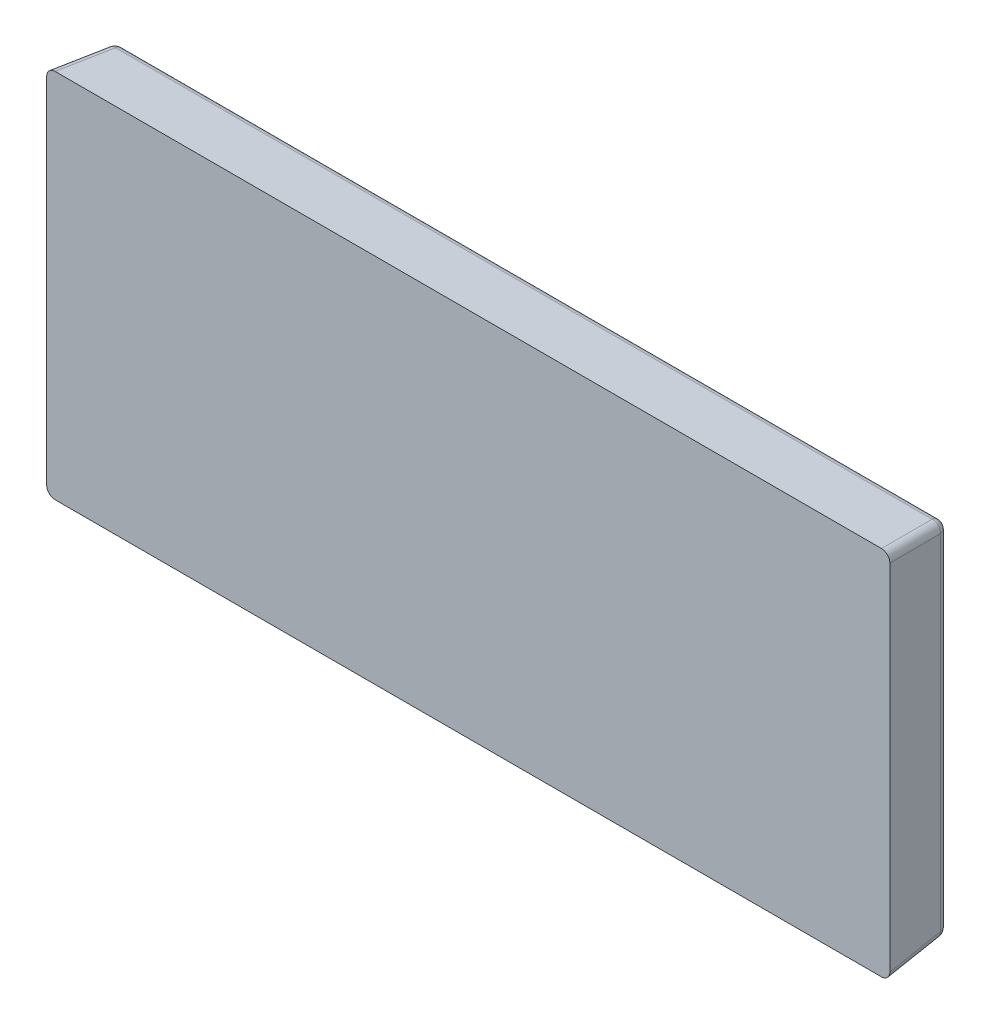
ISO-10303-21;
HEADER;
FILE_DESCRIPTION(('STEP AP214'),'2;1');
FILE_NAME('part.step','',(''),(''),'','','');
FILE_SCHEMA(('AUTOMOTIVE_DESIGN { 1 0 10303 214 1 1 1 1 }'));
ENDSEC;
DATA;
#1=APPLICATION_CONTEXT('core data for automotive mechanical design processes');
#2=APPLICATION_PROTOCOL_DEFINITION('international standard','automotive_design',2000,#1);
#3=PRODUCT_CONTEXT('',#1,'mechanical');
#4=PRODUCT('Part','Part','',(#3));
#5=PRODUCT_RELATED_PRODUCT_CATEGORY('part','',(#4));
#6=PRODUCT_DEFINITION_FORMATION('','',#4);
#7=PRODUCT_DEFINITION_CONTEXT('part definition',#1,'design');
#8=PRODUCT_DEFINITION('design','',#6,#7);
#9=PRODUCT_DEFINITION_SHAPE('','',#8);
#10=(LENGTH_UNIT() NAMED_UNIT(*) SI_UNIT(.MILLI.,.METRE.));
#11=(NAMED_UNIT(*) PLANE_ANGLE_UNIT() SI_UNIT($,.RADIAN.));
#12=(NAMED_UNIT(*) SI_UNIT($,.STERADIAN.) SOLID_ANGLE_UNIT());
#13=UNCERTAINTY_MEASURE_WITH_UNIT(LENGTH_MEASURE(1.E-05),#10,'distance_accuracy_value','');
#14=(GEOMETRIC_REPRESENTATION_CONTEXT(3) GLOBAL_UNCERTAINTY_ASSIGNED_CONTEXT((#13)) GLOBAL_UNIT_ASSIGNED_CONTEXT((#10,
#11,#12)) REPRESENTATION_CONTEXT('',''));
#15=CARTESIAN_POINT('',(0.,0.,0.));
#16=DIRECTION('',(0.,0.,1.));
#17=DIRECTION('',(1.,0.,0.));
#18=AXIS2_PLACEMENT_3D('',#15,#16,#17);
#19=CARTESIAN_POINT('',(-5.,-2.2,-0.75));
#20=DIRECTION('',(0.,0.,-1.));
#21=DIRECTION('',(0.,-1.,0.));
#22=AXIS2_PLACEMENT_3D('',#19,#20,#21);
#23=PLANE('',#22);
#24=DIRECTION('',(0.,-1.,0.));
#25=VECTOR('',#24,1.);
#26=CARTESIAN_POINT('',(-4.84275038495381,-2.2,-0.75));
#27=LINE('',#26,#25);
#28=CARTESIAN_POINT('',(-4.84275038495382,2.04275038495382,-0.75));
#29=VERTEX_POINT('',#28);
#30=CARTESIAN_POINT('',(-4.84275038495381,-2.04275038495382,-0.75));
#31=VERTEX_POINT('',#30);
#32=EDGE_CURVE('E41',#29,#31,#27,.T.);
#33=ORIENTED_EDGE('',*,*,#32,.F.);
#34=DIRECTION('',(-1.,0.,0.));
#35=VECTOR('',#34,1.);
#36=CARTESIAN_POINT('',(-5.,2.04275038495382,-0.75));
#37=LINE('',#36,#35);
#38=CARTESIAN_POINT('',(4.84275038495382,2.04275038495382,-0.75));
#39=VERTEX_POINT('',#38);
#40=EDGE_CURVE('E11',#39,#29,#37,.T.);
#41=ORIENTED_EDGE('',*,*,#40,.F.);
#42=DIRECTION('',(0.,1.,0.));
#43=VECTOR('',#42,1.);
#44=CARTESIAN_POINT('',(4.84275038495382,-2.2,-0.75));
#45=LINE('',#44,#43);
#46=CARTESIAN_POINT('',(4.84275038495382,-2.04275038495382,-0.75));
#47=VERTEX_POINT('',#46);
#48=EDGE_CURVE('E193',#47,#39,#45,.T.);
#49=ORIENTED_EDGE('',*,*,#48,.F.);
#50=DIRECTION('',(1.,0.,0.));
#51=VECTOR('',#50,1.);
#52=CARTESIAN_POINT('',(-5.,-2.04275038495382,-0.75));
#53=LINE('',#52,#51);
#54=EDGE_CURVE('E185',#31,#47,#53,.T.);
#55=ORIENTED_EDGE('',*,*,#54,.F.);
#56=EDGE_LOOP('',(#33,#41,#49,#55));
#57=FACE_BOUND('',#56,.T.);
#58=ADVANCED_FACE('F16',(#57),#23,.T.);
#59=CARTESIAN_POINT('',(-4.84275038495382,2.04275038495382,-0.65));
#60=DIRECTION('',(-0.754900044750231,0.,0.655839860359294));
#61=DIRECTION('',(-0.359708459501919,-0.836170262039059,-0.414039994498464));
#62=AXIS2_PLACEMENT_3D('',#59,#60,#61);
#63=SPHERICAL_SURFACE('',#62,0.0999999999999954);
#64=CARTESIAN_POINT('',(-4.84275038495382,2.04275038495382,-0.65));
#65=DIRECTION('',(1.,0.,0.));
#66=DIRECTION('',(0.,0.,-1.));
#67=AXIS2_PLACEMENT_3D('',#64,#65,#66);
#68=CIRCLE('',#67,0.1);
#69=CARTESIAN_POINT('',(-4.84275038495382,2.14236985476299,-0.658715574274766));
#70=VERTEX_POINT('',#69);
#71=EDGE_CURVE('E27',#29,#70,#68,.T.);
#72=ORIENTED_EDGE('',*,*,#71,.F.);
#73=CARTESIAN_POINT('',(-4.84275038495382,2.04275038495382,-0.65));
#74=DIRECTION('',(0.,-1.,0.));
#75=DIRECTION('',(-1.,0.,0.));
#76=AXIS2_PLACEMENT_3D('',#73,#74,#75);
#77=CIRCLE('',#76,0.1);
#78=CARTESIAN_POINT('',(-4.94236985476299,2.04275038495382,-0.658715574274766));
#79=VERTEX_POINT('',#78);
#80=EDGE_CURVE('E204',#79,#29,#77,.T.);
#81=ORIENTED_EDGE('',*,*,#80,.F.);
#82=CARTESIAN_POINT('',(-4.84275038495382,2.04275038495382,-0.65));
#83=DIRECTION('',(-0.0868265938642476,0.0868265938642477,0.992432509138967));
#84=DIRECTION('',(0.996194698091746,0.,0.0871557427476582));
#85=AXIS2_PLACEMENT_3D('',#82,#83,#84);
#86=CIRCLE('',#85,0.1);
#87=EDGE_CURVE('E207',#70,#79,#86,.T.);
#88=ORIENTED_EDGE('',*,*,#87,.F.);
#89=EDGE_LOOP('',(#72,#81,#88));
#90=FACE_BOUND('',#89,.T.);
#91=ADVANCED_FACE('F322',(#90),#63,.T.);
#92=CARTESIAN_POINT('',(-5.,2.04275038495382,-0.65));
#93=DIRECTION('',(1.,0.,0.));
#94=DIRECTION('',(0.,0.,-1.));
#95=AXIS2_PLACEMENT_3D('',#92,#93,#94);
#96=CYLINDRICAL_SURFACE('',#95,0.1);
#97=CARTESIAN_POINT('',(4.84275038495382,2.04275038495382,-0.65));
#98=DIRECTION('',(1.,0.,0.));
#99=DIRECTION('',(0.,1.,0.));
#100=AXIS2_PLACEMENT_3D('',#97,#98,#99);
#101=CIRCLE('',#100,0.1);
#102=CARTESIAN_POINT('',(4.84275038495381,2.14236985476299,-0.658715574274766));
#103=VERTEX_POINT('',#102);
#104=EDGE_CURVE('E163',#39,#103,#101,.T.);
#105=ORIENTED_EDGE('',*,*,#104,.F.);
#106=ORIENTED_EDGE('',*,*,#40,.T.);
#107=ORIENTED_EDGE('',*,*,#71,.T.);
#108=DIRECTION('',(-1.,0.,0.));
#109=VECTOR('',#108,1.);
#110=CARTESIAN_POINT('',(-5.,2.14236985476299,-0.658715574274766));
#111=LINE('',#110,#109);
#112=EDGE_CURVE('E211',#103,#70,#111,.T.);
#113=ORIENTED_EDGE('',*,*,#112,.F.);
#114=EDGE_LOOP('',(#105,#106,#107,#113));
#115=FACE_BOUND('',#114,.T.);
#116=ADVANCED_FACE('F340',(#115),#96,.T.);
#117=CARTESIAN_POINT('',(4.84275038495382,2.04275038495382,-0.65));
#118=DIRECTION('',(-0.754900044750259,0.,-0.655839860359263));
#119=DIRECTION('',(0.359708459501887,-0.836170262039073,-0.414039994498463));
#120=AXIS2_PLACEMENT_3D('',#117,#118,#119);
#121=SPHERICAL_SURFACE('',#120,0.1);
#122=CARTESIAN_POINT('',(4.84275038495381,2.04275038495382,-0.65));
#123=DIRECTION('',(0.0868265938642476,0.0868265938642476,0.992432509138967));
#124=DIRECTION('',(0.,-0.996194698091746,0.0871557427476582));
#125=AXIS2_PLACEMENT_3D('',#122,#123,#124);
#126=CIRCLE('',#125,0.1);
#127=CARTESIAN_POINT('',(4.94236985476299,2.04275038495382,-0.658715574274766));
#128=VERTEX_POINT('',#127);
#129=EDGE_CURVE('E181',#128,#103,#126,.T.);
#130=ORIENTED_EDGE('',*,*,#129,.F.);
#131=CARTESIAN_POINT('',(4.84275038495382,2.04275038495382,-0.65));
#132=DIRECTION('',(0.,-1.,0.));
#133=DIRECTION('',(1.,0.,0.));
#134=AXIS2_PLACEMENT_3D('',#131,#132,#133);
#135=CIRCLE('',#134,0.1);
#136=EDGE_CURVE('E189',#39,#128,#135,.T.);
#137=ORIENTED_EDGE('',*,*,#136,.F.);
#138=ORIENTED_EDGE('',*,*,#104,.T.);
#139=EDGE_LOOP('',(#130,#137,#138));
#140=FACE_BOUND('',#139,.T.);
#141=ADVANCED_FACE('F18',(#140),#121,.T.);
#142=CARTESIAN_POINT('',(4.84275038495382,-2.2,-0.65));
#143=DIRECTION('',(0.,-1.,0.));
#144=DIRECTION('',(1.,0.,0.));
#145=AXIS2_PLACEMENT_3D('',#142,#143,#144);
#146=CYLINDRICAL_SURFACE('',#145,0.1);
#147=CARTESIAN_POINT('',(4.84275038495382,-2.04275038495382,-0.65));
#148=DIRECTION('',(0.,-1.,0.));
#149=DIRECTION('',(1.,0.,0.));
#150=AXIS2_PLACEMENT_3D('',#147,#148,#149);
#151=CIRCLE('',#150,0.1);
#152=CARTESIAN_POINT('',(4.94236985476299,-2.04275038495382,-0.658715574274766));
#153=VERTEX_POINT('',#152);
#154=EDGE_CURVE('E188',#47,#153,#151,.T.);
#155=ORIENTED_EDGE('',*,*,#154,.F.);
#156=ORIENTED_EDGE('',*,*,#48,.T.);
#157=ORIENTED_EDGE('',*,*,#136,.T.);
#158=DIRECTION('',(0.,1.,0.));
#159=VECTOR('',#158,1.);
#160=CARTESIAN_POINT('',(4.94236985476299,2.2,-0.658715574274766));
#161=LINE('',#160,#159);
#162=EDGE_CURVE('E133',#153,#128,#161,.T.);
#163=ORIENTED_EDGE('',*,*,#162,.F.);
#164=EDGE_LOOP('',(#155,#156,#157,#163));
#165=FACE_BOUND('',#164,.T.);
#166=ADVANCED_FACE('F343',(#165),#146,.T.);
#167=CARTESIAN_POINT('',(4.84275038495381,-2.04275038495382,-0.65));
#168=DIRECTION('',(-0.754900044750212,0.,-0.655839860359317));
#169=DIRECTION('',(-0.35970845950191,-0.83617026203908,0.414039994498429));
#170=AXIS2_PLACEMENT_3D('',#167,#168,#169);
#171=SPHERICAL_SURFACE('',#170,0.1);
#172=CARTESIAN_POINT('',(4.84275038495382,-2.04275038495382,-0.65));
#173=DIRECTION('',(0.0868265938642476,-0.0868265938642477,0.992432509138967));
#174=DIRECTION('',(0.996194698091746,0.,-0.0871557427476582));
#175=AXIS2_PLACEMENT_3D('',#172,#173,#174);
#176=CIRCLE('',#175,0.1);
#177=CARTESIAN_POINT('',(4.84275038495382,-2.14236985476299,-0.658715574274766));
#178=VERTEX_POINT('',#177);
#179=EDGE_CURVE('E153',#178,#153,#176,.T.);
#180=ORIENTED_EDGE('',*,*,#179,.F.);
#181=CARTESIAN_POINT('',(4.84275038495382,-2.04275038495382,-0.65));
#182=DIRECTION('',(-1.,0.,0.));
#183=DIRECTION('',(0.,0.,1.));
#184=AXIS2_PLACEMENT_3D('',#181,#182,#183);
#185=CIRCLE('',#184,0.1);
#186=EDGE_CURVE('E167',#47,#178,#185,.T.);
#187=ORIENTED_EDGE('',*,*,#186,.F.);
#188=ORIENTED_EDGE('',*,*,#154,.T.);
#189=EDGE_LOOP('',(#180,#187,#188));
#190=FACE_BOUND('',#189,.T.);
#191=ADVANCED_FACE('F346',(#190),#171,.T.);
#192=CARTESIAN_POINT('',(-5.,-2.04275038495382,-0.65));
#193=DIRECTION('',(-1.,0.,0.));
#194=DIRECTION('',(0.,0.,1.));
#195=AXIS2_PLACEMENT_3D('',#192,#193,#194);
#196=CYLINDRICAL_SURFACE('',#195,0.1);
#197=CARTESIAN_POINT('',(-4.84275038495381,-2.04275038495382,-0.65));
#198=DIRECTION('',(-1.,0.,0.));
#199=DIRECTION('',(0.,1.,0.));
#200=AXIS2_PLACEMENT_3D('',#197,#198,#199);
#201=CIRCLE('',#200,0.1);
#202=CARTESIAN_POINT('',(-4.84275038495381,-2.14236985476299,-0.658715574274766));
#203=VERTEX_POINT('',#202);
#204=EDGE_CURVE('E165',#31,#203,#201,.T.);
#205=ORIENTED_EDGE('',*,*,#204,.F.);
#206=ORIENTED_EDGE('',*,*,#54,.T.);
#207=ORIENTED_EDGE('',*,*,#186,.T.);
#208=DIRECTION('',(1.,0.,0.));
#209=VECTOR('',#208,1.);
#210=CARTESIAN_POINT('',(5.,-2.14236985476299,-0.658715574274766));
#211=LINE('',#210,#209);
#212=EDGE_CURVE('E219',#203,#178,#211,.T.);
#213=ORIENTED_EDGE('',*,*,#212,.F.);
#214=EDGE_LOOP('',(#205,#206,#207,#213));
#215=FACE_BOUND('',#214,.T.);
#216=ADVANCED_FACE('F275',(#215),#196,.T.);
#217=CARTESIAN_POINT('',(-4.84275038495381,-2.04275038495382,-0.65));
#218=DIRECTION('',(-0.754900044750247,0.,0.655839860359276));
#219=DIRECTION('',(0.359708459501898,-0.83617026203907,0.414039994498459));
#220=AXIS2_PLACEMENT_3D('',#217,#218,#219);
#221=SPHERICAL_SURFACE('',#220,0.100000000000002);
#222=CARTESIAN_POINT('',(-4.84275038495381,-2.04275038495382,-0.65));
#223=DIRECTION('',(0.,1.,0.));
#224=DIRECTION('',(-1.,0.,0.));
#225=AXIS2_PLACEMENT_3D('',#222,#223,#224);
#226=CIRCLE('',#225,0.1);
#227=CARTESIAN_POINT('',(-4.94236985476299,-2.04275038495382,-0.658715574274766));
#228=VERTEX_POINT('',#227);
#229=EDGE_CURVE('E168',#31,#228,#226,.T.);
#230=ORIENTED_EDGE('',*,*,#229,.F.);
#231=ORIENTED_EDGE('',*,*,#204,.T.);
#232=CARTESIAN_POINT('',(-4.84275038495381,-2.04275038495382,-0.65));
#233=DIRECTION('',(-0.0868265938642476,-0.0868265938642476,0.992432509138967));
#234=DIRECTION('',(0.,-0.996194698091746,-0.0871557427476582));
#235=AXIS2_PLACEMENT_3D('',#232,#233,#234);
#236=CIRCLE('',#235,0.1);
#237=EDGE_CURVE('E180',#228,#203,#236,.T.);
#238=ORIENTED_EDGE('',*,*,#237,.F.);
#239=EDGE_LOOP('',(#230,#231,#238));
#240=FACE_BOUND('',#239,.T.);
#241=ADVANCED_FACE('F282',(#240),#221,.T.);
#242=CARTESIAN_POINT('',(-4.84275038495381,-2.2,-0.65));
#243=DIRECTION('',(0.,1.,0.));
#244=DIRECTION('',(-1.,0.,0.));
#245=AXIS2_PLACEMENT_3D('',#242,#243,#244);
#246=CYLINDRICAL_SURFACE('',#245,0.1);
#247=ORIENTED_EDGE('',*,*,#229,.T.);
#248=DIRECTION('',(0.,-1.,0.));
#249=VECTOR('',#248,1.);
#250=CARTESIAN_POINT('',(-4.94236985476299,-2.2,-0.658715574274766));
#251=LINE('',#250,#249);
#252=EDGE_CURVE('E175',#79,#228,#251,.T.);
#253=ORIENTED_EDGE('',*,*,#252,.F.);
#254=ORIENTED_EDGE('',*,*,#80,.T.);
#255=ORIENTED_EDGE('',*,*,#32,.T.);
#256=EDGE_LOOP('',(#247,#253,#254,#255));
#257=FACE_BOUND('',#256,.T.);
#258=ADVANCED_FACE('F324',(#257),#246,.T.);
#259=CARTESIAN_POINT('',(-4.90113154716819,2.10113154716819,0.0172997376062625));
#260=DIRECTION('',(-0.0868265938642477,0.0868265938642477,0.992432509138967));
#261=DIRECTION('',(0.996194698091746,0.,0.0871557427476583));
#262=AXIS2_PLACEMENT_3D('',#259,#260,#261);
#263=CYLINDRICAL_SURFACE('',#262,0.1);
#264=ORIENTED_EDGE('',*,*,#87,.T.);
#265=DIRECTION('',(0.0868265938642481,-0.0868265938642468,-0.992432509138967));
#266=VECTOR('',#265,1.);
#267=CARTESIAN_POINT('',(-5.,2.10038053019082,0.));
#268=LINE('',#267,#266);
#269=CARTESIAN_POINT('',(-5.,2.10038053019082,0.));
#270=VERTEX_POINT('',#269);
#271=EDGE_CURVE('E170',#270,#79,#268,.T.);
#272=ORIENTED_EDGE('',*,*,#271,.F.);
#273=CARTESIAN_POINT('',(-5.,2.10038053019082,0.));
#274=CARTESIAN_POINT('',(-5.,2.15882769356254,0.));
#275=CARTESIAN_POINT('',(-4.95882769356253,2.2,0.));
#276=CARTESIAN_POINT('',(-4.90038053019083,2.2,0.));
#277=(BOUNDED_CURVE() B_SPLINE_CURVE(3,(#273,#274,#275,#276),.UNSPECIFIED.,.F.,
.F.) B_SPLINE_CURVE_WITH_KNOTS((4,4),(5.50158524205541,7.06478537230375),
.UNSPECIFIED.) CURVE() GEOMETRIC_REPRESENTATION_ITEM() RATIONAL_B_SPLINE_CURVE((1.,
0.806524890385347,0.806524890385347,1.)) REPRESENTATION_ITEM(''));
#278=CARTESIAN_POINT('',(-4.90038053019083,2.2,0.));
#279=VERTEX_POINT('',#278);
#280=EDGE_CURVE('E225',#270,#279,#277,.T.);
#281=ORIENTED_EDGE('',*,*,#280,.T.);
#282=DIRECTION('',(-0.0868265938642481,0.0868265938642475,0.992432509138967));
#283=VECTOR('',#282,1.);
#284=CARTESIAN_POINT('',(-4.84275038495382,2.14236985476299,-0.658715574274766));
#285=LINE('',#284,#283);
#286=EDGE_CURVE('E184',#70,#279,#285,.T.);
#287=ORIENTED_EDGE('',*,*,#286,.F.);
#288=EDGE_LOOP('',(#264,#272,#281,#287));
#289=FACE_BOUND('',#288,.T.);
#290=ADVANCED_FACE('F319',(#289),#263,.T.);
#291=CARTESIAN_POINT('',(-5.,2.2,0.));
#292=DIRECTION('',(0.,0.996194698091746,-0.0871557427476582));
#293=DIRECTION('',(-1.,0.,0.));
#294=AXIS2_PLACEMENT_3D('',#291,#292,#293);
#295=PLANE('',#294);
#296=DIRECTION('',(1.,0.,0.));
#297=VECTOR('',#296,1.);
#298=CARTESIAN_POINT('',(-5.,2.2,0.));
#299=LINE('',#298,#297);
#300=CARTESIAN_POINT('',(4.90038053019083,2.2,0.));
#301=VERTEX_POINT('',#300);
#302=EDGE_CURVE('E214',#279,#301,#299,.T.);
#303=ORIENTED_EDGE('',*,*,#302,.T.);
#304=DIRECTION('',(0.0868265938642476,0.0868265938642476,0.992432509138967));
#305=VECTOR('',#304,1.);
#306=CARTESIAN_POINT('',(4.90113154716819,2.20075101697736,0.00858416333149666));
#307=LINE('',#306,#305);
#308=EDGE_CURVE('E142',#103,#301,#307,.T.);
#309=ORIENTED_EDGE('',*,*,#308,.F.);
#310=ORIENTED_EDGE('',*,*,#112,.T.);
#311=ORIENTED_EDGE('',*,*,#286,.T.);
#312=EDGE_LOOP('',(#303,#309,#310,#311));
#313=FACE_BOUND('',#312,.T.);
#314=ADVANCED_FACE('F315',(#313),#295,.T.);
#315=CARTESIAN_POINT('',(4.90113154716819,2.10113154716819,0.0172997376062625));
#316=DIRECTION('',(0.0868265938642476,0.0868265938642477,0.992432509138967));
#317=DIRECTION('',(0.,-0.996194698091746,0.0871557427476583));
#318=AXIS2_PLACEMENT_3D('',#315,#316,#317);
#319=CYLINDRICAL_SURFACE('',#318,0.1);
#320=ORIENTED_EDGE('',*,*,#129,.T.);
#321=ORIENTED_EDGE('',*,*,#308,.T.);
#322=CARTESIAN_POINT('',(4.90038053019083,2.2,0.));
#323=CARTESIAN_POINT('',(4.95882769356253,2.2,0.));
#324=CARTESIAN_POINT('',(5.,2.15882769356253,0.));
#325=CARTESIAN_POINT('',(5.,2.10038053019082,0.));
#326=(BOUNDED_CURVE() B_SPLINE_CURVE(3,(#322,#323,#324,#325),.UNSPECIFIED.,.F.,
.F.) B_SPLINE_CURVE_WITH_KNOTS((4,4),(5.50158524205542,7.06478537230375),
.UNSPECIFIED.) CURVE() GEOMETRIC_REPRESENTATION_ITEM() RATIONAL_B_SPLINE_CURVE((1.,
0.806524890385349,0.806524890385349,1.)) REPRESENTATION_ITEM(''));
#327=CARTESIAN_POINT('',(5.,2.10038053019082,0.));
#328=VERTEX_POINT('',#327);
#329=EDGE_CURVE('E139',#301,#328,#326,.T.);
#330=ORIENTED_EDGE('',*,*,#329,.T.);
#331=DIRECTION('',(0.0868265938642481,0.0868265938642481,0.992432509138967));
#332=VECTOR('',#331,1.);
#333=CARTESIAN_POINT('',(4.94236985476299,2.04275038495382,-0.658715574274766));
#334=LINE('',#333,#332);
#335=EDGE_CURVE('E126',#128,#328,#334,.T.);
#336=ORIENTED_EDGE('',*,*,#335,.F.);
#337=EDGE_LOOP('',(#320,#321,#330,#336));
#338=FACE_BOUND('',#337,.T.);
#339=ADVANCED_FACE('F140',(#338),#319,.T.);
#340=CARTESIAN_POINT('',(5.,2.2,0.));
#341=DIRECTION('',(0.996194698091746,0.,-0.0871557427476582));
#342=DIRECTION('',(0.,-1.,0.));
#343=AXIS2_PLACEMENT_3D('',#340,#341,#342);
#344=PLANE('',#343);
#345=ORIENTED_EDGE('',*,*,#162,.T.);
#346=ORIENTED_EDGE('',*,*,#335,.T.);
#347=DIRECTION('',(0.,-1.,0.));
#348=VECTOR('',#347,1.);
#349=CARTESIAN_POINT('',(5.,-2.2,0.));
#350=LINE('',#349,#348);
#351=CARTESIAN_POINT('',(5.,-2.10038053019082,0.));
#352=VERTEX_POINT('',#351);
#353=EDGE_CURVE('E130',#328,#352,#350,.T.);
#354=ORIENTED_EDGE('',*,*,#353,.T.);
#355=DIRECTION('',(0.0868265938642477,-0.0868265938642476,0.992432509138967));
#356=VECTOR('',#355,1.);
#357=CARTESIAN_POINT('',(5.00075101697736,-2.10113154716819,0.00858416333149665));
#358=LINE('',#357,#356);
#359=EDGE_CURVE('E118',#153,#352,#358,.T.);
#360=ORIENTED_EDGE('',*,*,#359,.F.);
#361=EDGE_LOOP('',(#345,#346,#354,#360));
#362=FACE_BOUND('',#361,.T.);
#363=ADVANCED_FACE('F128',(#362),#344,.T.);
#364=CARTESIAN_POINT('',(4.90113154716819,-2.10113154716819,0.0172997376062625));
#365=DIRECTION('',(0.0868265938642477,-0.0868265938642477,0.992432509138967));
#366=DIRECTION('',(0.996194698091746,0.,-0.0871557427476583));
#367=AXIS2_PLACEMENT_3D('',#364,#365,#366);
#368=CYLINDRICAL_SURFACE('',#367,0.1);
#369=ORIENTED_EDGE('',*,*,#179,.T.);
#370=ORIENTED_EDGE('',*,*,#359,.T.);
#371=CARTESIAN_POINT('',(5.,-2.10038053019082,0.));
#372=CARTESIAN_POINT('',(5.,-2.15882769356253,0.));
#373=CARTESIAN_POINT('',(4.95882769356253,-2.2,0.));
#374=CARTESIAN_POINT('',(4.90038053019083,-2.2,0.));
#375=(BOUNDED_CURVE() B_SPLINE_CURVE(3,(#371,#372,#373,#374),.UNSPECIFIED.,.F.,
.F.) B_SPLINE_CURVE_WITH_KNOTS((4,4),(5.50158524205542,7.06478537230375),
.UNSPECIFIED.) CURVE() GEOMETRIC_REPRESENTATION_ITEM() RATIONAL_B_SPLINE_CURVE((1.,
0.806524890385349,0.806524890385349,1.)) REPRESENTATION_ITEM(''));
#376=CARTESIAN_POINT('',(4.90038053019083,-2.2,0.));
#377=VERTEX_POINT('',#376);
#378=EDGE_CURVE('E151',#352,#377,#375,.T.);
#379=ORIENTED_EDGE('',*,*,#378,.T.);
#380=DIRECTION('',(0.0868265938642481,-0.0868265938642475,0.992432509138967));
#381=VECTOR('',#380,1.);
#382=CARTESIAN_POINT('',(4.84275038495382,-2.14236985476299,-0.658715574274766));
#383=LINE('',#382,#381);
#384=EDGE_CURVE('E20',#178,#377,#383,.T.);
#385=ORIENTED_EDGE('',*,*,#384,.F.);
#386=EDGE_LOOP('',(#369,#370,#379,#385));
#387=FACE_BOUND('',#386,.T.);
#388=ADVANCED_FACE('F352',(#387),#368,.T.);
#389=CARTESIAN_POINT('',(5.,-2.2,0.));
#390=DIRECTION('',(0.,-0.996194698091746,-0.0871557427476582));
#391=DIRECTION('',(0.,0.0871557427476582,-0.996194698091746));
#392=AXIS2_PLACEMENT_3D('',#389,#390,#391);
#393=PLANE('',#392);
#394=ORIENTED_EDGE('',*,*,#212,.T.);
#395=ORIENTED_EDGE('',*,*,#384,.T.);
#396=DIRECTION('',(-1.,0.,0.));
#397=VECTOR('',#396,1.);
#398=CARTESIAN_POINT('',(-5.,-2.2,0.));
#399=LINE('',#398,#397);
#400=CARTESIAN_POINT('',(-4.90038053019083,-2.2,0.));
#401=VERTEX_POINT('',#400);
#402=EDGE_CURVE('E176',#377,#401,#399,.T.);
#403=ORIENTED_EDGE('',*,*,#402,.T.);
#404=DIRECTION('',(-0.0868265938642476,-0.0868265938642476,0.992432509138967));
#405=VECTOR('',#404,1.);
#406=CARTESIAN_POINT('',(-4.90113154716819,-2.20075101697736,0.00858416333149665));
#407=LINE('',#406,#405);
#408=EDGE_CURVE('E228',#203,#401,#407,.T.);
#409=ORIENTED_EDGE('',*,*,#408,.F.);
#410=EDGE_LOOP('',(#394,#395,#403,#409));
#411=FACE_BOUND('',#410,.T.);
#412=ADVANCED_FACE('F283',(#411),#393,.T.);
#413=CARTESIAN_POINT('',(-4.90113154716819,-2.10113154716819,0.0172997376062625));
#414=DIRECTION('',(-0.0868265938642476,-0.0868265938642477,0.992432509138967));
#415=DIRECTION('',(0.,-0.996194698091746,-0.0871557427476583));
#416=AXIS2_PLACEMENT_3D('',#413,#414,#415);
#417=CYLINDRICAL_SURFACE('',#416,0.1);
#418=ORIENTED_EDGE('',*,*,#237,.T.);
#419=ORIENTED_EDGE('',*,*,#408,.T.);
#420=CARTESIAN_POINT('',(-4.90038053019083,-2.2,0.));
#421=CARTESIAN_POINT('',(-4.95882769356253,-2.2,0.));
#422=CARTESIAN_POINT('',(-5.,-2.15882769356253,0.));
#423=CARTESIAN_POINT('',(-5.,-2.10038053019082,0.));
#424=(BOUNDED_CURVE() B_SPLINE_CURVE(3,(#420,#421,#422,#423),.UNSPECIFIED.,.F.,
.F.) B_SPLINE_CURVE_WITH_KNOTS((4,4),(5.50158524205542,7.06478537230375),
.UNSPECIFIED.) CURVE() GEOMETRIC_REPRESENTATION_ITEM() RATIONAL_B_SPLINE_CURVE((1.,
0.806524890385349,0.806524890385349,1.)) REPRESENTATION_ITEM(''));
#425=CARTESIAN_POINT('',(-5.,-2.10038053019082,0.));
#426=VERTEX_POINT('',#425);
#427=EDGE_CURVE('E200',#401,#426,#424,.T.);
#428=ORIENTED_EDGE('',*,*,#427,.T.);
#429=DIRECTION('',(-0.0868265938642481,-0.0868265938642481,0.992432509138967));
#430=VECTOR('',#429,1.);
#431=CARTESIAN_POINT('',(-4.94236985476299,-2.04275038495382,-0.658715574274766));
#432=LINE('',#431,#430);
#433=EDGE_CURVE('E270',#228,#426,#432,.T.);
#434=ORIENTED_EDGE('',*,*,#433,.F.);
#435=EDGE_LOOP('',(#418,#419,#428,#434));
#436=FACE_BOUND('',#435,.T.);
#437=ADVANCED_FACE('F268',(#436),#417,.T.);
#438=CARTESIAN_POINT('',(-5.,-2.2,0.));
#439=DIRECTION('',(-0.996194698091746,0.,-0.0871557427476582));
#440=DIRECTION('',(-0.0871557427476582,0.,0.996194698091746));
#441=AXIS2_PLACEMENT_3D('',#438,#439,#440);
#442=PLANE('',#441);
#443=DIRECTION('',(0.,1.,0.));
#444=VECTOR('',#443,1.);
#445=CARTESIAN_POINT('',(-5.,-2.2,0.));
#446=LINE('',#445,#444);
#447=EDGE_CURVE('E174',#426,#270,#446,.T.);
#448=ORIENTED_EDGE('',*,*,#447,.T.);
#449=ORIENTED_EDGE('',*,*,#271,.T.);
#450=ORIENTED_EDGE('',*,*,#252,.T.);
#451=ORIENTED_EDGE('',*,*,#433,.T.);
#452=EDGE_LOOP('',(#448,#449,#450,#451));
#453=FACE_BOUND('',#452,.T.);
#454=ADVANCED_FACE('F287',(#453),#442,.T.);
#455=CARTESIAN_POINT('',(-5.,-2.2,0.));
#456=DIRECTION('',(0.,0.,-1.));
#457=DIRECTION('',(0.,-1.,0.));
#458=AXIS2_PLACEMENT_3D('',#455,#456,#457);
#459=PLANE('',#458);
#460=ORIENTED_EDGE('',*,*,#427,.F.);
#461=ORIENTED_EDGE('',*,*,#402,.F.);
#462=ORIENTED_EDGE('',*,*,#378,.F.);
#463=ORIENTED_EDGE('',*,*,#353,.F.);
#464=ORIENTED_EDGE('',*,*,#329,.F.);
#465=ORIENTED_EDGE('',*,*,#302,.F.);
#466=ORIENTED_EDGE('',*,*,#280,.F.);
#467=ORIENTED_EDGE('',*,*,#447,.F.);
#468=EDGE_LOOP('',(#460,#461,#462,#463,#464,#465,#466,#467));
#469=FACE_BOUND('',#468,.T.);
#470=ADVANCED_FACE('F149',(#469),#459,.F.);
#471=CLOSED_SHELL('',(#58,#91,#116,#141,#166,#191,#216,#241,#258,#290,#314,#339,#363,#388,#412,
#437,#454,#470));
#472=MANIFOLD_SOLID_BREP('B1',#471);
#473=ADVANCED_BREP_SHAPE_REPRESENTATION('',(#18,#472),#14);
#474=SHAPE_DEFINITION_REPRESENTATION(#9,#473);
ENDSEC;
END-ISO-10303-21;
